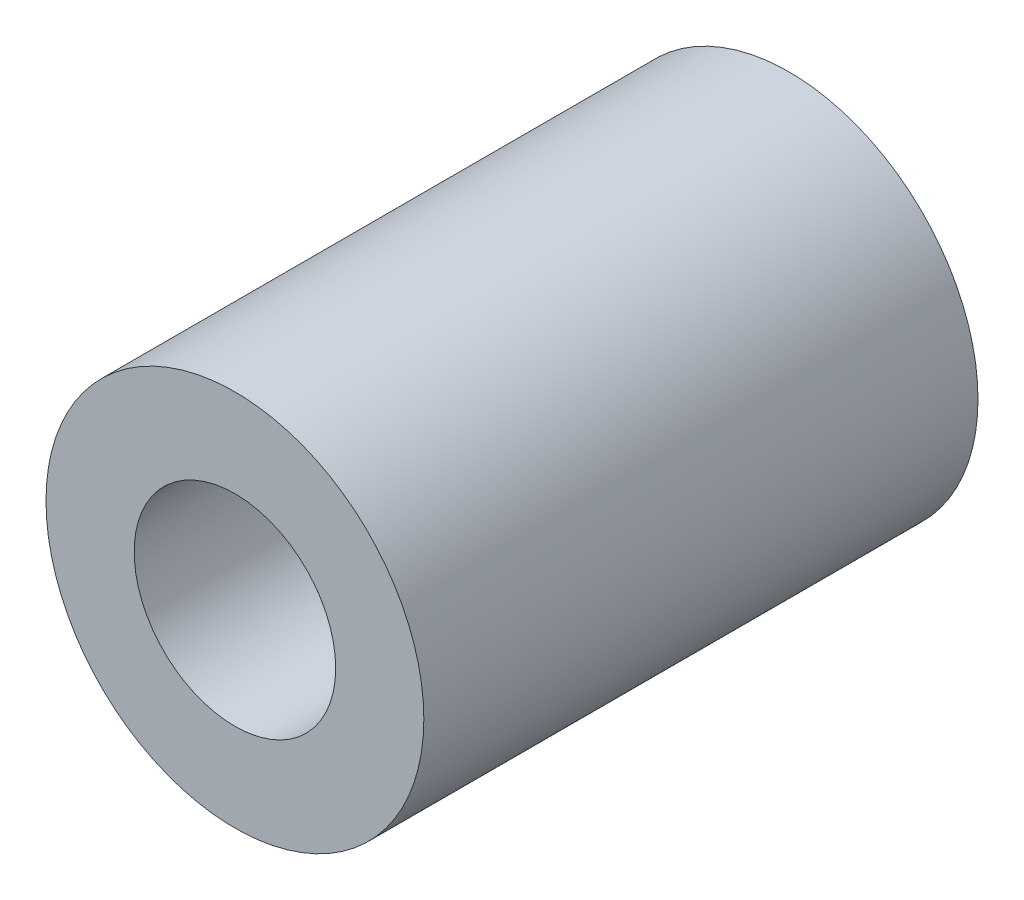
ISO-10303-21;
HEADER;
FILE_DESCRIPTION(('STEP AP214'),'2;1');
FILE_NAME('part.step','',(''),(''),'','','');
FILE_SCHEMA(('AUTOMOTIVE_DESIGN { 1 0 10303 214 1 1 1 1 }'));
ENDSEC;
DATA;
#1=APPLICATION_CONTEXT('core data for automotive mechanical design processes');
#2=APPLICATION_PROTOCOL_DEFINITION('international standard','automotive_design',2000,#1);
#3=PRODUCT_CONTEXT('',#1,'mechanical');
#4=PRODUCT('Part','Part','',(#3));
#5=PRODUCT_RELATED_PRODUCT_CATEGORY('part','',(#4));
#6=PRODUCT_DEFINITION_FORMATION('','',#4);
#7=PRODUCT_DEFINITION_CONTEXT('part definition',#1,'design');
#8=PRODUCT_DEFINITION('design','',#6,#7);
#9=PRODUCT_DEFINITION_SHAPE('','',#8);
#10=(LENGTH_UNIT() NAMED_UNIT(*) SI_UNIT(.MILLI.,.METRE.));
#11=(NAMED_UNIT(*) PLANE_ANGLE_UNIT() SI_UNIT($,.RADIAN.));
#12=(NAMED_UNIT(*) SI_UNIT($,.STERADIAN.) SOLID_ANGLE_UNIT());
#13=UNCERTAINTY_MEASURE_WITH_UNIT(LENGTH_MEASURE(1.E-05),#10,'distance_accuracy_value','');
#14=(GEOMETRIC_REPRESENTATION_CONTEXT(3) GLOBAL_UNCERTAINTY_ASSIGNED_CONTEXT((#13)) GLOBAL_UNIT_ASSIGNED_CONTEXT((#10,
#11,#12)) REPRESENTATION_CONTEXT('',''));
#15=CARTESIAN_POINT('',(0.,0.,0.));
#16=DIRECTION('',(0.,0.,1.));
#17=DIRECTION('',(1.,0.,0.));
#18=AXIS2_PLACEMENT_3D('',#15,#16,#17);
#19=CARTESIAN_POINT('',(0.,0.,22.));
#20=DIRECTION('',(0.,0.,1.));
#21=DIRECTION('',(1.,0.,0.));
#22=AXIS2_PLACEMENT_3D('',#19,#20,#21);
#23=PLANE('',#22);
#24=CARTESIAN_POINT('',(0.,0.,22.));
#25=DIRECTION('',(0.,0.,1.));
#26=DIRECTION('',(1.,0.,0.));
#27=AXIS2_PLACEMENT_3D('',#24,#25,#26);
#28=CIRCLE('',#27,7.5);
#29=CARTESIAN_POINT('',(7.5,0.,22.));
#30=VERTEX_POINT('',#29);
#31=EDGE_CURVE('E10',#30,#30,#28,.T.);
#32=ORIENTED_EDGE('',*,*,#31,.T.);
#33=EDGE_LOOP('',(#32));
#34=FACE_BOUND('',#33,.T.);
#35=CARTESIAN_POINT('',(0.,0.,22.));
#36=DIRECTION('',(0.,0.,1.));
#37=DIRECTION('',(1.,0.,0.));
#38=AXIS2_PLACEMENT_3D('',#35,#36,#37);
#39=CIRCLE('',#38,4.);
#40=CARTESIAN_POINT('',(4.,0.,22.));
#41=VERTEX_POINT('',#40);
#42=EDGE_CURVE('E42',#41,#41,#39,.T.);
#43=ORIENTED_EDGE('',*,*,#42,.F.);
#44=EDGE_LOOP('',(#43));
#45=FACE_BOUND('',#44,.T.);
#46=ADVANCED_FACE('F31',(#34,#45),#23,.T.);
#47=CARTESIAN_POINT('',(0.,0.,0.));
#48=DIRECTION('',(0.,0.,1.));
#49=DIRECTION('',(1.,0.,0.));
#50=AXIS2_PLACEMENT_3D('',#47,#48,#49);
#51=PLANE('',#50);
#52=CARTESIAN_POINT('',(0.,0.,0.));
#53=DIRECTION('',(0.,0.,1.));
#54=DIRECTION('',(1.,0.,0.));
#55=AXIS2_PLACEMENT_3D('',#52,#53,#54);
#56=CIRCLE('',#55,7.5);
#57=CARTESIAN_POINT('',(7.5,0.,0.));
#58=VERTEX_POINT('',#57);
#59=EDGE_CURVE('E35',#58,#58,#56,.T.);
#60=ORIENTED_EDGE('',*,*,#59,.F.);
#61=EDGE_LOOP('',(#60));
#62=FACE_BOUND('',#61,.T.);
#63=CARTESIAN_POINT('',(0.,0.,0.));
#64=DIRECTION('',(0.,0.,1.));
#65=DIRECTION('',(1.,0.,0.));
#66=AXIS2_PLACEMENT_3D('',#63,#64,#65);
#67=CIRCLE('',#66,4.);
#68=CARTESIAN_POINT('',(4.,0.,0.));
#69=VERTEX_POINT('',#68);
#70=EDGE_CURVE('E44',#69,#69,#67,.T.);
#71=ORIENTED_EDGE('',*,*,#70,.T.);
#72=EDGE_LOOP('',(#71));
#73=FACE_BOUND('',#72,.T.);
#74=ADVANCED_FACE('F54',(#62,#73),#51,.F.);
#75=CARTESIAN_POINT('',(0.,0.,22.));
#76=DIRECTION('',(0.,0.,-1.));
#77=DIRECTION('',(-1.,0.,0.));
#78=AXIS2_PLACEMENT_3D('',#75,#76,#77);
#79=CYLINDRICAL_SURFACE('',#78,7.5);
#80=ORIENTED_EDGE('',*,*,#31,.F.);
#81=EDGE_LOOP('',(#80));
#82=FACE_BOUND('',#81,.T.);
#83=ORIENTED_EDGE('',*,*,#59,.T.);
#84=EDGE_LOOP('',(#83));
#85=FACE_BOUND('',#84,.T.);
#86=ADVANCED_FACE('F33',(#82,#85),#79,.T.);
#87=CARTESIAN_POINT('',(0.,0.,22.));
#88=DIRECTION('',(0.,0.,-1.));
#89=DIRECTION('',(-1.,0.,0.));
#90=AXIS2_PLACEMENT_3D('',#87,#88,#89);
#91=CYLINDRICAL_SURFACE('',#90,4.);
#92=ORIENTED_EDGE('',*,*,#42,.T.);
#93=EDGE_LOOP('',(#92));
#94=FACE_BOUND('',#93,.T.);
#95=ORIENTED_EDGE('',*,*,#70,.F.);
#96=EDGE_LOOP('',(#95));
#97=FACE_BOUND('',#96,.T.);
#98=ADVANCED_FACE('F50',(#94,#97),#91,.F.);
#99=CLOSED_SHELL('',(#46,#74,#86,#98));
#100=MANIFOLD_SOLID_BREP('B2',#99);
#101=ADVANCED_BREP_SHAPE_REPRESENTATION('',(#18,#100),#14);
#102=SHAPE_DEFINITION_REPRESENTATION(#9,#101);
ENDSEC;
END-ISO-10303-21;
